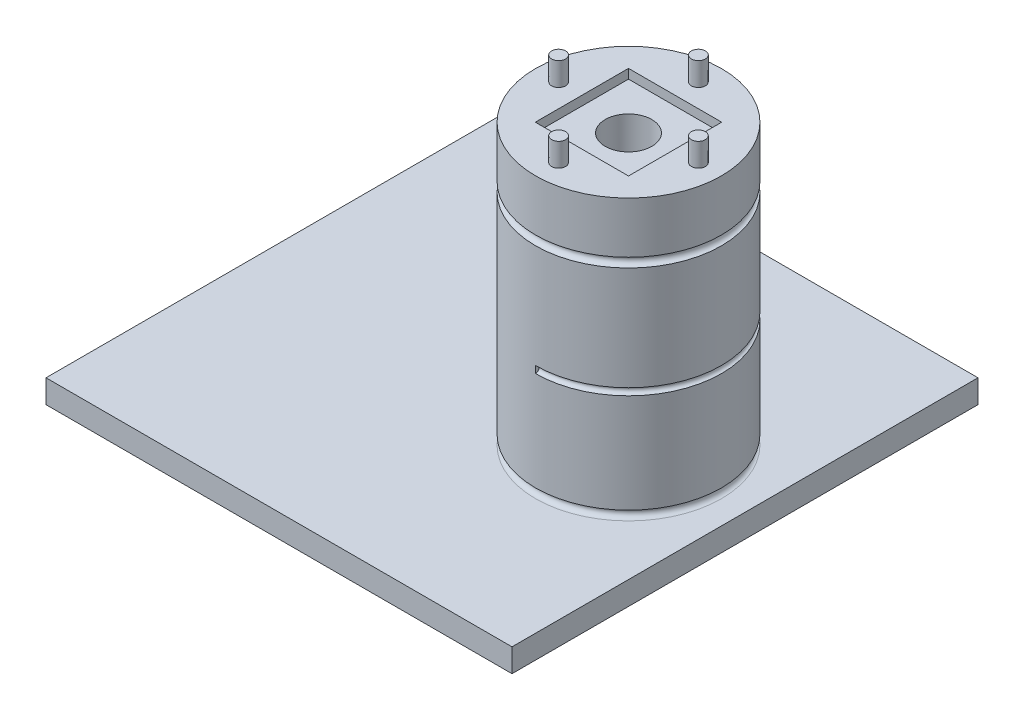
ISO-10303-21;
HEADER;
FILE_DESCRIPTION(('STEP AP214'),'2;1');
FILE_NAME('part.step','',(''),(''),'','','');
FILE_SCHEMA(('AUTOMOTIVE_DESIGN { 1 0 10303 214 1 1 1 1 }'));
ENDSEC;
DATA;
#1=APPLICATION_CONTEXT('core data for automotive mechanical design processes');
#2=APPLICATION_PROTOCOL_DEFINITION('international standard','automotive_design',2000,#1);
#3=PRODUCT_CONTEXT('',#1,'mechanical');
#4=PRODUCT('Part','Part','',(#3));
#5=PRODUCT_RELATED_PRODUCT_CATEGORY('part','',(#4));
#6=PRODUCT_DEFINITION_FORMATION('','',#4);
#7=PRODUCT_DEFINITION_CONTEXT('part definition',#1,'design');
#8=PRODUCT_DEFINITION('design','',#6,#7);
#9=PRODUCT_DEFINITION_SHAPE('','',#8);
#10=(LENGTH_UNIT() NAMED_UNIT(*) SI_UNIT(.MILLI.,.METRE.));
#11=(NAMED_UNIT(*) PLANE_ANGLE_UNIT() SI_UNIT($,.RADIAN.));
#12=(NAMED_UNIT(*) SI_UNIT($,.STERADIAN.) SOLID_ANGLE_UNIT());
#13=UNCERTAINTY_MEASURE_WITH_UNIT(LENGTH_MEASURE(1.E-05),#10,'distance_accuracy_value','');
#14=(GEOMETRIC_REPRESENTATION_CONTEXT(3) GLOBAL_UNCERTAINTY_ASSIGNED_CONTEXT((#13)) GLOBAL_UNIT_ASSIGNED_CONTEXT((#10,
#11,#12)) REPRESENTATION_CONTEXT('',''));
#15=CARTESIAN_POINT('',(0.,0.,0.));
#16=DIRECTION('',(0.,0.,1.));
#17=DIRECTION('',(1.,0.,0.));
#18=AXIS2_PLACEMENT_3D('',#15,#16,#17);
#19=CARTESIAN_POINT('',(0.,65.,0.));
#20=DIRECTION('',(0.,-1.,0.));
#21=DIRECTION('',(0.,0.,-1.));
#22=AXIS2_PLACEMENT_3D('',#19,#20,#21);
#23=CYLINDRICAL_SURFACE('',#22,19.95);
#24=CARTESIAN_POINT('',(0.,29.75,0.));
#25=DIRECTION('',(0.,-1.,0.));
#26=DIRECTION('',(0.,0.,-1.));
#27=AXIS2_PLACEMENT_3D('',#24,#25,#26);
#28=CIRCLE('',#27,19.95);
#29=CARTESIAN_POINT('',(-1.39310105419841E-13,29.75,-19.95));
#30=VERTEX_POINT('',#29);
#31=CARTESIAN_POINT('',(0.,29.75,19.95));
#32=VERTEX_POINT('',#31);
#33=EDGE_CURVE('E226',#30,#32,#28,.T.);
#34=ORIENTED_EDGE('',*,*,#33,.F.);
#35=DIRECTION('',(0.,-1.,0.));
#36=VECTOR('',#35,1.);
#37=CARTESIAN_POINT('',(-1.39310105419841E-13,65.,-19.95));
#38=LINE('',#37,#36);
#39=CARTESIAN_POINT('',(-1.39310105419841E-13,28.25,-19.95));
#40=VERTEX_POINT('',#39);
#41=EDGE_CURVE('E11',#30,#40,#38,.T.);
#42=ORIENTED_EDGE('',*,*,#41,.T.);
#43=CARTESIAN_POINT('',(0.,28.25,0.));
#44=DIRECTION('',(0.,1.,0.));
#45=DIRECTION('',(0.,0.,1.));
#46=AXIS2_PLACEMENT_3D('',#43,#44,#45);
#47=CIRCLE('',#46,19.95);
#48=CARTESIAN_POINT('',(0.,28.25,19.95));
#49=VERTEX_POINT('',#48);
#50=EDGE_CURVE('E48',#49,#40,#47,.T.);
#51=ORIENTED_EDGE('',*,*,#50,.F.);
#52=DIRECTION('',(0.,-1.,0.));
#53=VECTOR('',#52,1.);
#54=CARTESIAN_POINT('',(0.,65.,19.95));
#55=LINE('',#54,#53);
#56=EDGE_CURVE('E222',#32,#49,#55,.T.);
#57=ORIENTED_EDGE('',*,*,#56,.F.);
#58=EDGE_LOOP('',(#34,#42,#51,#57));
#59=FACE_BOUND('',#58,.T.);
#60=CARTESIAN_POINT('',(0.,52.,0.));
#61=DIRECTION('',(0.,1.,0.));
#62=DIRECTION('',(0.,0.,1.));
#63=AXIS2_PLACEMENT_3D('',#60,#61,#62);
#64=CIRCLE('',#63,19.95);
#65=CARTESIAN_POINT('',(0.,52.,19.95));
#66=VERTEX_POINT('',#65);
#67=EDGE_CURVE('E215',#66,#66,#64,.F.);
#68=ORIENTED_EDGE('',*,*,#67,.T.);
#69=EDGE_LOOP('',(#68));
#70=FACE_BOUND('',#69,.T.);
#71=CARTESIAN_POINT('',(0.,7.,0.));
#72=DIRECTION('',(0.,-1.,0.));
#73=DIRECTION('',(0.,0.,-1.));
#74=AXIS2_PLACEMENT_3D('',#71,#72,#73);
#75=CIRCLE('',#74,19.95);
#76=CARTESIAN_POINT('',(0.,7.,-19.95));
#77=VERTEX_POINT('',#76);
#78=EDGE_CURVE('E176',#77,#77,#75,.F.);
#79=ORIENTED_EDGE('',*,*,#78,.T.);
#80=EDGE_LOOP('',(#79));
#81=FACE_BOUND('',#80,.T.);
#82=ADVANCED_FACE('F39',(#59,#70,#81),#23,.T.);
#83=CARTESIAN_POINT('',(0.,6.,0.));
#84=DIRECTION('',(0.,-1.,0.));
#85=DIRECTION('',(0.,0.,-1.));
#86=AXIS2_PLACEMENT_3D('',#83,#84,#85);
#87=TOROIDAL_SURFACE('',#86,19.95,1.);
#88=ORIENTED_EDGE('',*,*,#78,.F.);
#89=EDGE_LOOP('',(#88));
#90=FACE_BOUND('',#89,.T.);
#91=CARTESIAN_POINT('',(0.,5.,0.));
#92=DIRECTION('',(0.,1.,0.));
#93=DIRECTION('',(0.,0.,1.));
#94=AXIS2_PLACEMENT_3D('',#91,#92,#93);
#95=CIRCLE('',#94,19.95);
#96=CARTESIAN_POINT('',(0.,5.,19.95));
#97=VERTEX_POINT('',#96);
#98=EDGE_CURVE('E172',#97,#97,#95,.F.);
#99=ORIENTED_EDGE('',*,*,#98,.F.);
#100=EDGE_LOOP('',(#99));
#101=FACE_BOUND('',#100,.T.);
#102=ADVANCED_FACE('F249',(#90,#101),#87,.F.);
#103=CARTESIAN_POINT('',(0.,0.,0.));
#104=DIRECTION('',(0.,-1.,0.));
#105=DIRECTION('',(0.,0.,-1.));
#106=AXIS2_PLACEMENT_3D('',#103,#104,#105);
#107=PLANE('',#106);
#108=DIRECTION('',(0.,0.,1.));
#109=VECTOR('',#108,1.);
#110=CARTESIAN_POINT('',(-75.,0.,-50.));
#111=LINE('',#110,#109);
#112=CARTESIAN_POINT('',(-75.,0.,-50.));
#113=VERTEX_POINT('',#112);
#114=CARTESIAN_POINT('',(-75.,0.,50.));
#115=VERTEX_POINT('',#114);
#116=EDGE_CURVE('E182',#113,#115,#111,.T.);
#117=ORIENTED_EDGE('',*,*,#116,.F.);
#118=DIRECTION('',(-1.,0.,0.));
#119=VECTOR('',#118,1.);
#120=CARTESIAN_POINT('',(25.,0.,-50.));
#121=LINE('',#120,#119);
#122=CARTESIAN_POINT('',(25.,0.,-50.));
#123=VERTEX_POINT('',#122);
#124=EDGE_CURVE('E187',#123,#113,#121,.T.);
#125=ORIENTED_EDGE('',*,*,#124,.F.);
#126=DIRECTION('',(0.,0.,-1.));
#127=VECTOR('',#126,1.);
#128=CARTESIAN_POINT('',(25.,0.,-50.));
#129=LINE('',#128,#127);
#130=CARTESIAN_POINT('',(25.,0.,50.));
#131=VERTEX_POINT('',#130);
#132=EDGE_CURVE('E198',#131,#123,#129,.T.);
#133=ORIENTED_EDGE('',*,*,#132,.F.);
#134=DIRECTION('',(1.,0.,0.));
#135=VECTOR('',#134,1.);
#136=CARTESIAN_POINT('',(25.,0.,50.));
#137=LINE('',#136,#135);
#138=EDGE_CURVE('E196',#115,#131,#137,.T.);
#139=ORIENTED_EDGE('',*,*,#138,.F.);
#140=EDGE_LOOP('',(#117,#125,#133,#139));
#141=FACE_BOUND('',#140,.T.);
#142=ADVANCED_FACE('F255',(#141),#107,.T.);
#143=CARTESIAN_POINT('',(25.,5.,-50.));
#144=DIRECTION('',(0.,0.,1.));
#145=DIRECTION('',(1.,0.,0.));
#146=AXIS2_PLACEMENT_3D('',#143,#144,#145);
#147=PLANE('',#146);
#148=ORIENTED_EDGE('',*,*,#124,.T.);
#149=DIRECTION('',(0.,-1.,0.));
#150=VECTOR('',#149,1.);
#151=CARTESIAN_POINT('',(-75.,5.,-50.));
#152=LINE('',#151,#150);
#153=CARTESIAN_POINT('',(-75.,5.,-50.));
#154=VERTEX_POINT('',#153);
#155=EDGE_CURVE('E193',#154,#113,#152,.T.);
#156=ORIENTED_EDGE('',*,*,#155,.F.);
#157=DIRECTION('',(-1.,0.,0.));
#158=VECTOR('',#157,1.);
#159=CARTESIAN_POINT('',(25.,5.,-50.));
#160=LINE('',#159,#158);
#161=CARTESIAN_POINT('',(25.,5.,-50.));
#162=VERTEX_POINT('',#161);
#163=EDGE_CURVE('E191',#162,#154,#160,.T.);
#164=ORIENTED_EDGE('',*,*,#163,.F.);
#165=DIRECTION('',(0.,-1.,0.));
#166=VECTOR('',#165,1.);
#167=CARTESIAN_POINT('',(25.,5.,-50.));
#168=LINE('',#167,#166);
#169=EDGE_CURVE('E203',#162,#123,#168,.T.);
#170=ORIENTED_EDGE('',*,*,#169,.T.);
#171=EDGE_LOOP('',(#148,#156,#164,#170));
#172=FACE_BOUND('',#171,.T.);
#173=ADVANCED_FACE('F303',(#172),#147,.F.);
#174=CARTESIAN_POINT('',(25.,5.,-50.));
#175=DIRECTION('',(-1.,0.,0.));
#176=DIRECTION('',(0.,0.,1.));
#177=AXIS2_PLACEMENT_3D('',#174,#175,#176);
#178=PLANE('',#177);
#179=ORIENTED_EDGE('',*,*,#132,.T.);
#180=ORIENTED_EDGE('',*,*,#169,.F.);
#181=DIRECTION('',(0.,0.,-1.));
#182=VECTOR('',#181,1.);
#183=CARTESIAN_POINT('',(25.,5.,-50.));
#184=LINE('',#183,#182);
#185=CARTESIAN_POINT('',(25.,5.,50.));
#186=VERTEX_POINT('',#185);
#187=EDGE_CURVE('E189',#186,#162,#184,.T.);
#188=ORIENTED_EDGE('',*,*,#187,.F.);
#189=DIRECTION('',(0.,-1.,0.));
#190=VECTOR('',#189,1.);
#191=CARTESIAN_POINT('',(25.,5.,50.));
#192=LINE('',#191,#190);
#193=EDGE_CURVE('E206',#186,#131,#192,.T.);
#194=ORIENTED_EDGE('',*,*,#193,.T.);
#195=EDGE_LOOP('',(#179,#180,#188,#194));
#196=FACE_BOUND('',#195,.T.);
#197=ADVANCED_FACE('F300',(#196),#178,.F.);
#198=CARTESIAN_POINT('',(25.,5.,50.));
#199=DIRECTION('',(0.,0.,-1.));
#200=DIRECTION('',(-1.,0.,0.));
#201=AXIS2_PLACEMENT_3D('',#198,#199,#200);
#202=PLANE('',#201);
#203=ORIENTED_EDGE('',*,*,#138,.T.);
#204=ORIENTED_EDGE('',*,*,#193,.F.);
#205=DIRECTION('',(1.,0.,0.));
#206=VECTOR('',#205,1.);
#207=CARTESIAN_POINT('',(25.,5.,50.));
#208=LINE('',#207,#206);
#209=CARTESIAN_POINT('',(-75.,5.,50.));
#210=VERTEX_POINT('',#209);
#211=EDGE_CURVE('E186',#210,#186,#208,.T.);
#212=ORIENTED_EDGE('',*,*,#211,.F.);
#213=DIRECTION('',(0.,-1.,0.));
#214=VECTOR('',#213,1.);
#215=CARTESIAN_POINT('',(-75.,5.,50.));
#216=LINE('',#215,#214);
#217=EDGE_CURVE('E209',#210,#115,#216,.T.);
#218=ORIENTED_EDGE('',*,*,#217,.T.);
#219=EDGE_LOOP('',(#203,#204,#212,#218));
#220=FACE_BOUND('',#219,.T.);
#221=ADVANCED_FACE('F295',(#220),#202,.F.);
#222=CARTESIAN_POINT('',(-75.,5.,-50.));
#223=DIRECTION('',(1.,0.,0.));
#224=DIRECTION('',(0.,0.,-1.));
#225=AXIS2_PLACEMENT_3D('',#222,#223,#224);
#226=PLANE('',#225);
#227=ORIENTED_EDGE('',*,*,#116,.T.);
#228=ORIENTED_EDGE('',*,*,#217,.F.);
#229=DIRECTION('',(0.,0.,1.));
#230=VECTOR('',#229,1.);
#231=CARTESIAN_POINT('',(-75.,5.,-50.));
#232=LINE('',#231,#230);
#233=EDGE_CURVE('E183',#154,#210,#232,.T.);
#234=ORIENTED_EDGE('',*,*,#233,.F.);
#235=ORIENTED_EDGE('',*,*,#155,.T.);
#236=EDGE_LOOP('',(#227,#228,#234,#235));
#237=FACE_BOUND('',#236,.T.);
#238=ADVANCED_FACE('F41',(#237),#226,.F.);
#239=CARTESIAN_POINT('',(0.,5.,0.));
#240=DIRECTION('',(0.,-1.,0.));
#241=DIRECTION('',(0.,0.,-1.));
#242=AXIS2_PLACEMENT_3D('',#239,#240,#241);
#243=PLANE('',#242);
#244=ORIENTED_EDGE('',*,*,#98,.T.);
#245=EDGE_LOOP('',(#244));
#246=FACE_BOUND('',#245,.T.);
#247=ORIENTED_EDGE('',*,*,#233,.T.);
#248=ORIENTED_EDGE('',*,*,#211,.T.);
#249=ORIENTED_EDGE('',*,*,#187,.T.);
#250=ORIENTED_EDGE('',*,*,#163,.T.);
#251=EDGE_LOOP('',(#247,#248,#249,#250));
#252=FACE_BOUND('',#251,.T.);
#253=ADVANCED_FACE('F277',(#246,#252),#243,.F.);
#254=CARTESIAN_POINT('',(0.,53.,0.));
#255=DIRECTION('',(0.,-1.,0.));
#256=DIRECTION('',(0.,0.,-1.));
#257=AXIS2_PLACEMENT_3D('',#254,#255,#256);
#258=TOROIDAL_SURFACE('',#257,19.95,1.);
#259=CARTESIAN_POINT('',(0.,54.,0.));
#260=DIRECTION('',(0.,-1.,0.));
#261=DIRECTION('',(0.,0.,-1.));
#262=AXIS2_PLACEMENT_3D('',#259,#260,#261);
#263=CIRCLE('',#262,19.95);
#264=CARTESIAN_POINT('',(0.,54.,-19.95));
#265=VERTEX_POINT('',#264);
#266=EDGE_CURVE('E171',#265,#265,#263,.F.);
#267=ORIENTED_EDGE('',*,*,#266,.F.);
#268=EDGE_LOOP('',(#267));
#269=FACE_BOUND('',#268,.T.);
#270=ORIENTED_EDGE('',*,*,#67,.F.);
#271=EDGE_LOOP('',(#270));
#272=FACE_BOUND('',#271,.T.);
#273=ADVANCED_FACE('F268',(#269,#272),#258,.F.);
#274=CARTESIAN_POINT('',(0.,65.,0.));
#275=DIRECTION('',(0.,1.,0.));
#276=DIRECTION('',(0.,0.,1.));
#277=AXIS2_PLACEMENT_3D('',#274,#275,#276);
#278=PLANE('',#277);
#279=CARTESIAN_POINT('',(15.,65.,0.));
#280=DIRECTION('',(0.,1.,0.));
#281=DIRECTION('',(0.,0.,1.));
#282=AXIS2_PLACEMENT_3D('',#279,#280,#281);
#283=CIRCLE('',#282,1.5);
#284=CARTESIAN_POINT('',(15.,65.,1.5));
#285=VERTEX_POINT('',#284);
#286=EDGE_CURVE('E632',#285,#285,#283,.T.);
#287=ORIENTED_EDGE('',*,*,#286,.F.);
#288=EDGE_LOOP('',(#287));
#289=FACE_BOUND('',#288,.T.);
#290=CARTESIAN_POINT('',(-15.,65.,0.));
#291=DIRECTION('',(0.,1.,0.));
#292=DIRECTION('',(0.,0.,1.));
#293=AXIS2_PLACEMENT_3D('',#290,#291,#292);
#294=CIRCLE('',#293,1.5);
#295=CARTESIAN_POINT('',(-15.,65.,1.5));
#296=VERTEX_POINT('',#295);
#297=EDGE_CURVE('E638',#296,#296,#294,.T.);
#298=ORIENTED_EDGE('',*,*,#297,.F.);
#299=EDGE_LOOP('',(#298));
#300=FACE_BOUND('',#299,.T.);
#301=CARTESIAN_POINT('',(0.,65.,-15.));
#302=DIRECTION('',(0.,1.,0.));
#303=DIRECTION('',(0.,0.,1.));
#304=AXIS2_PLACEMENT_3D('',#301,#302,#303);
#305=CIRCLE('',#304,1.5);
#306=CARTESIAN_POINT('',(0.,65.,-13.5));
#307=VERTEX_POINT('',#306);
#308=EDGE_CURVE('E644',#307,#307,#305,.T.);
#309=ORIENTED_EDGE('',*,*,#308,.F.);
#310=EDGE_LOOP('',(#309));
#311=FACE_BOUND('',#310,.T.);
#312=CARTESIAN_POINT('',(0.,65.,15.));
#313=DIRECTION('',(0.,1.,0.));
#314=DIRECTION('',(0.,0.,1.));
#315=AXIS2_PLACEMENT_3D('',#312,#313,#314);
#316=CIRCLE('',#315,1.5);
#317=CARTESIAN_POINT('',(0.,65.,16.5));
#318=VERTEX_POINT('',#317);
#319=EDGE_CURVE('E144',#318,#318,#316,.T.);
#320=ORIENTED_EDGE('',*,*,#319,.F.);
#321=EDGE_LOOP('',(#320));
#322=FACE_BOUND('',#321,.T.);
#323=DIRECTION('',(0.,0.,-1.));
#324=VECTOR('',#323,1.);
#325=CARTESIAN_POINT('',(10.,65.,10.));
#326=LINE('',#325,#324);
#327=CARTESIAN_POINT('',(10.,65.,10.));
#328=VERTEX_POINT('',#327);
#329=CARTESIAN_POINT('',(10.,65.,-10.));
#330=VERTEX_POINT('',#329);
#331=EDGE_CURVE('E55',#328,#330,#326,.T.);
#332=ORIENTED_EDGE('',*,*,#331,.F.);
#333=DIRECTION('',(1.,0.,0.));
#334=VECTOR('',#333,1.);
#335=CARTESIAN_POINT('',(-10.,65.,10.));
#336=LINE('',#335,#334);
#337=CARTESIAN_POINT('',(-10.,65.,10.));
#338=VERTEX_POINT('',#337);
#339=EDGE_CURVE('E138',#338,#328,#336,.T.);
#340=ORIENTED_EDGE('',*,*,#339,.F.);
#341=DIRECTION('',(0.,0.,1.));
#342=VECTOR('',#341,1.);
#343=CARTESIAN_POINT('',(-10.,65.,10.));
#344=LINE('',#343,#342);
#345=CARTESIAN_POINT('',(-10.,65.,-10.));
#346=VERTEX_POINT('',#345);
#347=EDGE_CURVE('E141',#346,#338,#344,.T.);
#348=ORIENTED_EDGE('',*,*,#347,.F.);
#349=DIRECTION('',(-1.,0.,0.));
#350=VECTOR('',#349,1.);
#351=CARTESIAN_POINT('',(-10.,65.,-10.));
#352=LINE('',#351,#350);
#353=EDGE_CURVE('E150',#330,#346,#352,.T.);
#354=ORIENTED_EDGE('',*,*,#353,.F.);
#355=EDGE_LOOP('',(#332,#340,#348,#354));
#356=FACE_BOUND('',#355,.T.);
#357=CARTESIAN_POINT('',(0.,65.,0.));
#358=DIRECTION('',(0.,1.,0.));
#359=DIRECTION('',(0.,0.,1.));
#360=AXIS2_PLACEMENT_3D('',#357,#358,#359);
#361=CIRCLE('',#360,19.95);
#362=CARTESIAN_POINT('',(0.,65.,19.95));
#363=VERTEX_POINT('',#362);
#364=EDGE_CURVE('E179',#363,#363,#361,.T.);
#365=ORIENTED_EDGE('',*,*,#364,.T.);
#366=EDGE_LOOP('',(#365));
#367=FACE_BOUND('',#366,.T.);
#368=ADVANCED_FACE('F261',(#289,#300,#311,#322,#356,#367),#278,.T.);
#369=ORIENTED_EDGE('',*,*,#266,.T.);
#370=EDGE_LOOP('',(#369));
#371=FACE_BOUND('',#370,.T.);
#372=ORIENTED_EDGE('',*,*,#364,.F.);
#373=EDGE_LOOP('',(#372));
#374=FACE_BOUND('',#373,.T.);
#375=ADVANCED_FACE('F251',(#371,#374),#23,.T.);
#376=CARTESIAN_POINT('',(0.,29.,0.));
#377=DIRECTION('',(0.,-1.,0.));
#378=DIRECTION('',(0.,0.,-1.));
#379=AXIS2_PLACEMENT_3D('',#376,#377,#378);
#380=TOROIDAL_SURFACE('',#379,19.95,0.750000000000002);
#381=ORIENTED_EDGE('',*,*,#50,.T.);
#382=CARTESIAN_POINT('',(-1.39310105419841E-13,29.,-19.95));
#383=DIRECTION('',(-1.,0.,0.));
#384=DIRECTION('',(0.,0.,1.));
#385=AXIS2_PLACEMENT_3D('',#382,#383,#384);
#386=CIRCLE('',#385,0.750000000000002);
#387=EDGE_CURVE('E161',#40,#30,#386,.T.);
#388=ORIENTED_EDGE('',*,*,#387,.T.);
#389=ORIENTED_EDGE('',*,*,#33,.T.);
#390=CARTESIAN_POINT('',(0.,29.,19.95));
#391=DIRECTION('',(1.,0.,0.));
#392=DIRECTION('',(0.,0.,-1.));
#393=AXIS2_PLACEMENT_3D('',#390,#391,#392);
#394=CIRCLE('',#393,0.750000000000002);
#395=EDGE_CURVE('E62',#49,#32,#394,.T.);
#396=ORIENTED_EDGE('',*,*,#395,.F.);
#397=EDGE_LOOP('',(#381,#388,#389,#396));
#398=FACE_BOUND('',#397,.T.);
#399=ADVANCED_FACE('F231',(#398),#380,.F.);
#400=CARTESIAN_POINT('',(-1.39310105419841E-13,29.,-19.95));
#401=DIRECTION('',(-1.,0.,0.));
#402=DIRECTION('',(0.,0.,1.));
#403=AXIS2_PLACEMENT_3D('',#400,#401,#402);
#404=PLANE('',#403);
#405=ORIENTED_EDGE('',*,*,#387,.F.);
#406=ORIENTED_EDGE('',*,*,#41,.F.);
#407=EDGE_LOOP('',(#405,#406));
#408=FACE_BOUND('',#407,.T.);
#409=ADVANCED_FACE('F236',(#408),#404,.F.);
#410=CARTESIAN_POINT('',(0.,29.,19.95));
#411=DIRECTION('',(1.,0.,0.));
#412=DIRECTION('',(0.,0.,-1.));
#413=AXIS2_PLACEMENT_3D('',#410,#411,#412);
#414=PLANE('',#413);
#415=ORIENTED_EDGE('',*,*,#56,.T.);
#416=ORIENTED_EDGE('',*,*,#395,.T.);
#417=EDGE_LOOP('',(#415,#416));
#418=FACE_BOUND('',#417,.T.);
#419=ADVANCED_FACE('F238',(#418),#414,.T.);
#420=CARTESIAN_POINT('',(0.,63.,0.));
#421=DIRECTION('',(0.,-1.,0.));
#422=DIRECTION('',(0.,0.,-1.));
#423=AXIS2_PLACEMENT_3D('',#420,#421,#422);
#424=PLANE('',#423);
#425=DIRECTION('',(0.,0.,-1.));
#426=VECTOR('',#425,1.);
#427=CARTESIAN_POINT('',(10.,63.,10.));
#428=LINE('',#427,#426);
#429=CARTESIAN_POINT('',(10.,63.,10.));
#430=VERTEX_POINT('',#429);
#431=CARTESIAN_POINT('',(10.,63.,-10.));
#432=VERTEX_POINT('',#431);
#433=EDGE_CURVE('E119',#430,#432,#428,.T.);
#434=ORIENTED_EDGE('',*,*,#433,.T.);
#435=DIRECTION('',(-1.,0.,0.));
#436=VECTOR('',#435,1.);
#437=CARTESIAN_POINT('',(-10.,63.,-10.));
#438=LINE('',#437,#436);
#439=CARTESIAN_POINT('',(-10.,63.,-10.));
#440=VERTEX_POINT('',#439);
#441=EDGE_CURVE('E128',#432,#440,#438,.T.);
#442=ORIENTED_EDGE('',*,*,#441,.T.);
#443=DIRECTION('',(0.,0.,1.));
#444=VECTOR('',#443,1.);
#445=CARTESIAN_POINT('',(-10.,63.,10.));
#446=LINE('',#445,#444);
#447=CARTESIAN_POINT('',(-10.,63.,10.));
#448=VERTEX_POINT('',#447);
#449=EDGE_CURVE('E133',#440,#448,#446,.T.);
#450=ORIENTED_EDGE('',*,*,#449,.T.);
#451=DIRECTION('',(1.,0.,0.));
#452=VECTOR('',#451,1.);
#453=CARTESIAN_POINT('',(-10.,63.,10.));
#454=LINE('',#453,#452);
#455=EDGE_CURVE('E125',#448,#430,#454,.T.);
#456=ORIENTED_EDGE('',*,*,#455,.T.);
#457=EDGE_LOOP('',(#434,#442,#450,#456));
#458=FACE_BOUND('',#457,.T.);
#459=CARTESIAN_POINT('',(0.,63.,0.));
#460=DIRECTION('',(0.,-1.,0.));
#461=DIRECTION('',(0.,0.,-1.));
#462=AXIS2_PLACEMENT_3D('',#459,#460,#461);
#463=CIRCLE('',#462,5.);
#464=CARTESIAN_POINT('',(0.,63.,-5.));
#465=VERTEX_POINT('',#464);
#466=EDGE_CURVE('E43',#465,#465,#463,.F.);
#467=ORIENTED_EDGE('',*,*,#466,.F.);
#468=EDGE_LOOP('',(#467));
#469=FACE_BOUND('',#468,.T.);
#470=ADVANCED_FACE('F135',(#458,#469),#424,.F.);
#471=CARTESIAN_POINT('',(10.,63.,10.));
#472=DIRECTION('',(1.,0.,0.));
#473=DIRECTION('',(0.,0.,-1.));
#474=AXIS2_PLACEMENT_3D('',#471,#472,#473);
#475=PLANE('',#474);
#476=ORIENTED_EDGE('',*,*,#331,.T.);
#477=DIRECTION('',(0.,1.,0.));
#478=VECTOR('',#477,1.);
#479=CARTESIAN_POINT('',(10.,63.,-10.));
#480=LINE('',#479,#478);
#481=EDGE_CURVE('E115',#432,#330,#480,.T.);
#482=ORIENTED_EDGE('',*,*,#481,.F.);
#483=ORIENTED_EDGE('',*,*,#433,.F.);
#484=DIRECTION('',(0.,1.,0.));
#485=VECTOR('',#484,1.);
#486=CARTESIAN_POINT('',(10.,63.,10.));
#487=LINE('',#486,#485);
#488=EDGE_CURVE('E155',#430,#328,#487,.T.);
#489=ORIENTED_EDGE('',*,*,#488,.T.);
#490=EDGE_LOOP('',(#476,#482,#483,#489));
#491=FACE_BOUND('',#490,.T.);
#492=ADVANCED_FACE('F117',(#491),#475,.F.);
#493=CARTESIAN_POINT('',(-10.,63.,10.));
#494=DIRECTION('',(0.,0.,1.));
#495=DIRECTION('',(1.,0.,0.));
#496=AXIS2_PLACEMENT_3D('',#493,#494,#495);
#497=PLANE('',#496);
#498=ORIENTED_EDGE('',*,*,#339,.T.);
#499=ORIENTED_EDGE('',*,*,#488,.F.);
#500=ORIENTED_EDGE('',*,*,#455,.F.);
#501=DIRECTION('',(0.,1.,0.));
#502=VECTOR('',#501,1.);
#503=CARTESIAN_POINT('',(-10.,63.,10.));
#504=LINE('',#503,#502);
#505=EDGE_CURVE('E157',#448,#338,#504,.T.);
#506=ORIENTED_EDGE('',*,*,#505,.T.);
#507=EDGE_LOOP('',(#498,#499,#500,#506));
#508=FACE_BOUND('',#507,.T.);
#509=ADVANCED_FACE('F455',(#508),#497,.F.);
#510=CARTESIAN_POINT('',(-10.,63.,10.));
#511=DIRECTION('',(-1.,0.,0.));
#512=DIRECTION('',(0.,0.,1.));
#513=AXIS2_PLACEMENT_3D('',#510,#511,#512);
#514=PLANE('',#513);
#515=ORIENTED_EDGE('',*,*,#347,.T.);
#516=ORIENTED_EDGE('',*,*,#505,.F.);
#517=ORIENTED_EDGE('',*,*,#449,.F.);
#518=DIRECTION('',(0.,1.,0.));
#519=VECTOR('',#518,1.);
#520=CARTESIAN_POINT('',(-10.,63.,-10.));
#521=LINE('',#520,#519);
#522=EDGE_CURVE('E124',#440,#346,#521,.T.);
#523=ORIENTED_EDGE('',*,*,#522,.T.);
#524=EDGE_LOOP('',(#515,#516,#517,#523));
#525=FACE_BOUND('',#524,.T.);
#526=ADVANCED_FACE('F447',(#525),#514,.F.);
#527=CARTESIAN_POINT('',(-10.,63.,-10.));
#528=DIRECTION('',(0.,0.,-1.));
#529=DIRECTION('',(-1.,0.,0.));
#530=AXIS2_PLACEMENT_3D('',#527,#528,#529);
#531=PLANE('',#530);
#532=ORIENTED_EDGE('',*,*,#353,.T.);
#533=ORIENTED_EDGE('',*,*,#522,.F.);
#534=ORIENTED_EDGE('',*,*,#441,.F.);
#535=ORIENTED_EDGE('',*,*,#481,.T.);
#536=EDGE_LOOP('',(#532,#533,#534,#535));
#537=FACE_BOUND('',#536,.T.);
#538=ADVANCED_FACE('F129',(#537),#531,.F.);
#539=CARTESIAN_POINT('',(0.,21.5,0.));
#540=DIRECTION('',(0.,1.,0.));
#541=DIRECTION('',(0.,0.,1.));
#542=AXIS2_PLACEMENT_3D('',#539,#540,#541);
#543=PLANE('',#542);
#544=CARTESIAN_POINT('',(0.,21.5,0.));
#545=DIRECTION('',(0.,1.,0.));
#546=DIRECTION('',(0.,0.,1.));
#547=AXIS2_PLACEMENT_3D('',#544,#545,#546);
#548=CIRCLE('',#547,5.);
#549=CARTESIAN_POINT('',(0.,21.5,5.));
#550=VERTEX_POINT('',#549);
#551=EDGE_CURVE('E175',#550,#550,#548,.T.);
#552=ORIENTED_EDGE('',*,*,#551,.T.);
#553=EDGE_LOOP('',(#552));
#554=FACE_BOUND('',#553,.T.);
#555=ADVANCED_FACE('F446',(#554),#543,.T.);
#556=CARTESIAN_POINT('',(0.,21.5,0.));
#557=DIRECTION('',(0.,1.,0.));
#558=DIRECTION('',(0.,0.,1.));
#559=AXIS2_PLACEMENT_3D('',#556,#557,#558);
#560=CYLINDRICAL_SURFACE('',#559,5.);
#561=ORIENTED_EDGE('',*,*,#551,.F.);
#562=EDGE_LOOP('',(#561));
#563=FACE_BOUND('',#562,.T.);
#564=CARTESIAN_POINT('',(0.,36.,0.));
#565=DIRECTION('',(0.,1.,0.));
#566=DIRECTION('',(0.,0.,1.));
#567=AXIS2_PLACEMENT_3D('',#564,#565,#566);
#568=CIRCLE('',#567,5.);
#569=CARTESIAN_POINT('',(0.,36.,5.));
#570=VERTEX_POINT('',#569);
#571=EDGE_CURVE('E212',#570,#570,#568,.F.);
#572=ORIENTED_EDGE('',*,*,#571,.F.);
#573=EDGE_LOOP('',(#572));
#574=FACE_BOUND('',#573,.T.);
#575=ADVANCED_FACE('F521',(#563,#574),#560,.F.);
#576=CARTESIAN_POINT('',(0.,36.,0.));
#577=DIRECTION('',(0.,1.,0.));
#578=DIRECTION('',(0.,0.,1.));
#579=AXIS2_PLACEMENT_3D('',#576,#577,#578);
#580=PLANE('',#579);
#581=CARTESIAN_POINT('',(0.,36.,0.));
#582=DIRECTION('',(0.,1.,0.));
#583=DIRECTION('',(0.,0.,1.));
#584=AXIS2_PLACEMENT_3D('',#581,#582,#583);
#585=CIRCLE('',#584,2.7);
#586=CARTESIAN_POINT('',(0.,36.,2.7));
#587=VERTEX_POINT('',#586);
#588=EDGE_CURVE('E165',#587,#587,#585,.T.);
#589=ORIENTED_EDGE('',*,*,#588,.T.);
#590=EDGE_LOOP('',(#589));
#591=FACE_BOUND('',#590,.T.);
#592=ORIENTED_EDGE('',*,*,#571,.T.);
#593=EDGE_LOOP('',(#592));
#594=FACE_BOUND('',#593,.T.);
#595=ADVANCED_FACE('F504',(#591,#594),#580,.F.);
#596=CARTESIAN_POINT('',(0.,29.,0.));
#597=DIRECTION('',(0.,1.,0.));
#598=DIRECTION('',(0.,0.,1.));
#599=AXIS2_PLACEMENT_3D('',#596,#597,#598);
#600=CYLINDRICAL_SURFACE('',#599,2.7);
#601=CARTESIAN_POINT('',(0.,48.,0.));
#602=DIRECTION('',(0.,1.,0.));
#603=DIRECTION('',(0.,0.,1.));
#604=AXIS2_PLACEMENT_3D('',#601,#602,#603);
#605=CIRCLE('',#604,2.7);
#606=CARTESIAN_POINT('',(0.,48.,2.7));
#607=VERTEX_POINT('',#606);
#608=EDGE_CURVE('E164',#607,#607,#605,.T.);
#609=ORIENTED_EDGE('',*,*,#608,.T.);
#610=EDGE_LOOP('',(#609));
#611=FACE_BOUND('',#610,.T.);
#612=ORIENTED_EDGE('',*,*,#588,.F.);
#613=EDGE_LOOP('',(#612));
#614=FACE_BOUND('',#613,.T.);
#615=ADVANCED_FACE('F500',(#611,#614),#600,.F.);
#616=CARTESIAN_POINT('',(0.,48.,0.));
#617=DIRECTION('',(0.,1.,0.));
#618=DIRECTION('',(0.,0.,1.));
#619=AXIS2_PLACEMENT_3D('',#616,#617,#618);
#620=PLANE('',#619);
#621=ORIENTED_EDGE('',*,*,#608,.F.);
#622=EDGE_LOOP('',(#621));
#623=FACE_BOUND('',#622,.T.);
#624=CARTESIAN_POINT('',(0.,48.,0.));
#625=DIRECTION('',(0.,1.,0.));
#626=DIRECTION('',(0.,0.,1.));
#627=AXIS2_PLACEMENT_3D('',#624,#625,#626);
#628=CIRCLE('',#627,5.);
#629=CARTESIAN_POINT('',(0.,48.,5.));
#630=VERTEX_POINT('',#629);
#631=EDGE_CURVE('E168',#630,#630,#628,.T.);
#632=ORIENTED_EDGE('',*,*,#631,.T.);
#633=EDGE_LOOP('',(#632));
#634=FACE_BOUND('',#633,.T.);
#635=ADVANCED_FACE('F503',(#623,#634),#620,.T.);
#636=ORIENTED_EDGE('',*,*,#466,.T.);
#637=EDGE_LOOP('',(#636));
#638=FACE_BOUND('',#637,.T.);
#639=ORIENTED_EDGE('',*,*,#631,.F.);
#640=EDGE_LOOP('',(#639));
#641=FACE_BOUND('',#640,.T.);
#642=ADVANCED_FACE('F342',(#638,#641),#560,.F.);
#643=CARTESIAN_POINT('',(0.,70.,15.));
#644=DIRECTION('',(0.,-1.,0.));
#645=DIRECTION('',(0.,0.,-1.));
#646=AXIS2_PLACEMENT_3D('',#643,#644,#645);
#647=CYLINDRICAL_SURFACE('',#646,1.5);
#648=CARTESIAN_POINT('',(0.,70.,15.));
#649=DIRECTION('',(0.,1.,0.));
#650=DIRECTION('',(0.,0.,1.));
#651=AXIS2_PLACEMENT_3D('',#648,#649,#650);
#652=CIRCLE('',#651,1.5);
#653=CARTESIAN_POINT('',(0.,70.,16.5));
#654=VERTEX_POINT('',#653);
#655=EDGE_CURVE('E151',#654,#654,#652,.T.);
#656=ORIENTED_EDGE('',*,*,#655,.F.);
#657=EDGE_LOOP('',(#656));
#658=FACE_BOUND('',#657,.T.);
#659=ORIENTED_EDGE('',*,*,#319,.T.);
#660=EDGE_LOOP('',(#659));
#661=FACE_BOUND('',#660,.T.);
#662=ADVANCED_FACE('F346',(#658,#661),#647,.T.);
#663=CARTESIAN_POINT('',(0.,70.,15.));
#664=DIRECTION('',(0.,1.,0.));
#665=DIRECTION('',(0.,0.,1.));
#666=AXIS2_PLACEMENT_3D('',#663,#664,#665);
#667=PLANE('',#666);
#668=ORIENTED_EDGE('',*,*,#655,.T.);
#669=EDGE_LOOP('',(#668));
#670=FACE_BOUND('',#669,.T.);
#671=ADVANCED_FACE('F351',(#670),#667,.T.);
#672=CARTESIAN_POINT('',(0.,70.,-15.));
#673=DIRECTION('',(0.,-1.,0.));
#674=DIRECTION('',(0.,0.,-1.));
#675=AXIS2_PLACEMENT_3D('',#672,#673,#674);
#676=CYLINDRICAL_SURFACE('',#675,1.5);
#677=CARTESIAN_POINT('',(0.,70.,-15.));
#678=DIRECTION('',(0.,1.,0.));
#679=DIRECTION('',(0.,0.,1.));
#680=AXIS2_PLACEMENT_3D('',#677,#678,#679);
#681=CIRCLE('',#680,1.5);
#682=CARTESIAN_POINT('',(0.,70.,-13.5));
#683=VERTEX_POINT('',#682);
#684=EDGE_CURVE('E641',#683,#683,#681,.T.);
#685=ORIENTED_EDGE('',*,*,#684,.F.);
#686=EDGE_LOOP('',(#685));
#687=FACE_BOUND('',#686,.T.);
#688=ORIENTED_EDGE('',*,*,#308,.T.);
#689=EDGE_LOOP('',(#688));
#690=FACE_BOUND('',#689,.T.);
#691=ADVANCED_FACE('F363',(#687,#690),#676,.T.);
#692=CARTESIAN_POINT('',(0.,70.,-15.));
#693=DIRECTION('',(0.,1.,0.));
#694=DIRECTION('',(0.,0.,1.));
#695=AXIS2_PLACEMENT_3D('',#692,#693,#694);
#696=PLANE('',#695);
#697=ORIENTED_EDGE('',*,*,#684,.T.);
#698=EDGE_LOOP('',(#697));
#699=FACE_BOUND('',#698,.T.);
#700=ADVANCED_FACE('F374',(#699),#696,.T.);
#701=CARTESIAN_POINT('',(-15.,70.,0.));
#702=DIRECTION('',(0.,-1.,0.));
#703=DIRECTION('',(0.,0.,-1.));
#704=AXIS2_PLACEMENT_3D('',#701,#702,#703);
#705=CYLINDRICAL_SURFACE('',#704,1.5);
#706=CARTESIAN_POINT('',(-15.,70.,0.));
#707=DIRECTION('',(0.,1.,0.));
#708=DIRECTION('',(0.,0.,1.));
#709=AXIS2_PLACEMENT_3D('',#706,#707,#708);
#710=CIRCLE('',#709,1.5);
#711=CARTESIAN_POINT('',(-15.,70.,1.5));
#712=VERTEX_POINT('',#711);
#713=EDGE_CURVE('E635',#712,#712,#710,.T.);
#714=ORIENTED_EDGE('',*,*,#713,.F.);
#715=EDGE_LOOP('',(#714));
#716=FACE_BOUND('',#715,.T.);
#717=ORIENTED_EDGE('',*,*,#297,.T.);
#718=EDGE_LOOP('',(#717));
#719=FACE_BOUND('',#718,.T.);
#720=ADVANCED_FACE('F385',(#716,#719),#705,.T.);
#721=CARTESIAN_POINT('',(-15.,70.,0.));
#722=DIRECTION('',(0.,1.,0.));
#723=DIRECTION('',(0.,0.,1.));
#724=AXIS2_PLACEMENT_3D('',#721,#722,#723);
#725=PLANE('',#724);
#726=ORIENTED_EDGE('',*,*,#713,.T.);
#727=EDGE_LOOP('',(#726));
#728=FACE_BOUND('',#727,.T.);
#729=ADVANCED_FACE('F396',(#728),#725,.T.);
#730=CARTESIAN_POINT('',(15.,70.,0.));
#731=DIRECTION('',(0.,-1.,0.));
#732=DIRECTION('',(0.,0.,-1.));
#733=AXIS2_PLACEMENT_3D('',#730,#731,#732);
#734=CYLINDRICAL_SURFACE('',#733,1.5);
#735=CARTESIAN_POINT('',(15.,70.,0.));
#736=DIRECTION('',(0.,1.,0.));
#737=DIRECTION('',(0.,0.,1.));
#738=AXIS2_PLACEMENT_3D('',#735,#736,#737);
#739=CIRCLE('',#738,1.5);
#740=CARTESIAN_POINT('',(15.,70.,1.5));
#741=VERTEX_POINT('',#740);
#742=EDGE_CURVE('E631',#741,#741,#739,.T.);
#743=ORIENTED_EDGE('',*,*,#742,.F.);
#744=EDGE_LOOP('',(#743));
#745=FACE_BOUND('',#744,.T.);
#746=ORIENTED_EDGE('',*,*,#286,.T.);
#747=EDGE_LOOP('',(#746));
#748=FACE_BOUND('',#747,.T.);
#749=ADVANCED_FACE('F407',(#745,#748),#734,.T.);
#750=CARTESIAN_POINT('',(15.,70.,0.));
#751=DIRECTION('',(0.,1.,0.));
#752=DIRECTION('',(0.,0.,1.));
#753=AXIS2_PLACEMENT_3D('',#750,#751,#752);
#754=PLANE('',#753);
#755=ORIENTED_EDGE('',*,*,#742,.T.);
#756=EDGE_LOOP('',(#755));
#757=FACE_BOUND('',#756,.T.);
#758=ADVANCED_FACE('F418',(#757),#754,.T.);
#759=CLOSED_SHELL('',(#82,#102,#142,#173,#197,#221,#238,#253,#273,#368,#375,#399,#409,#419,#470,
#492,#509,#526,#538,#555,#575,#595,#615,#635,#642,#662,#671,#691,#700,#720,#729,#749,#758));
#760=MANIFOLD_SOLID_BREP('B2',#759);
#761=ADVANCED_BREP_SHAPE_REPRESENTATION('',(#18,#760),#14);
#762=SHAPE_DEFINITION_REPRESENTATION(#9,#761);
ENDSEC;
END-ISO-10303-21;
